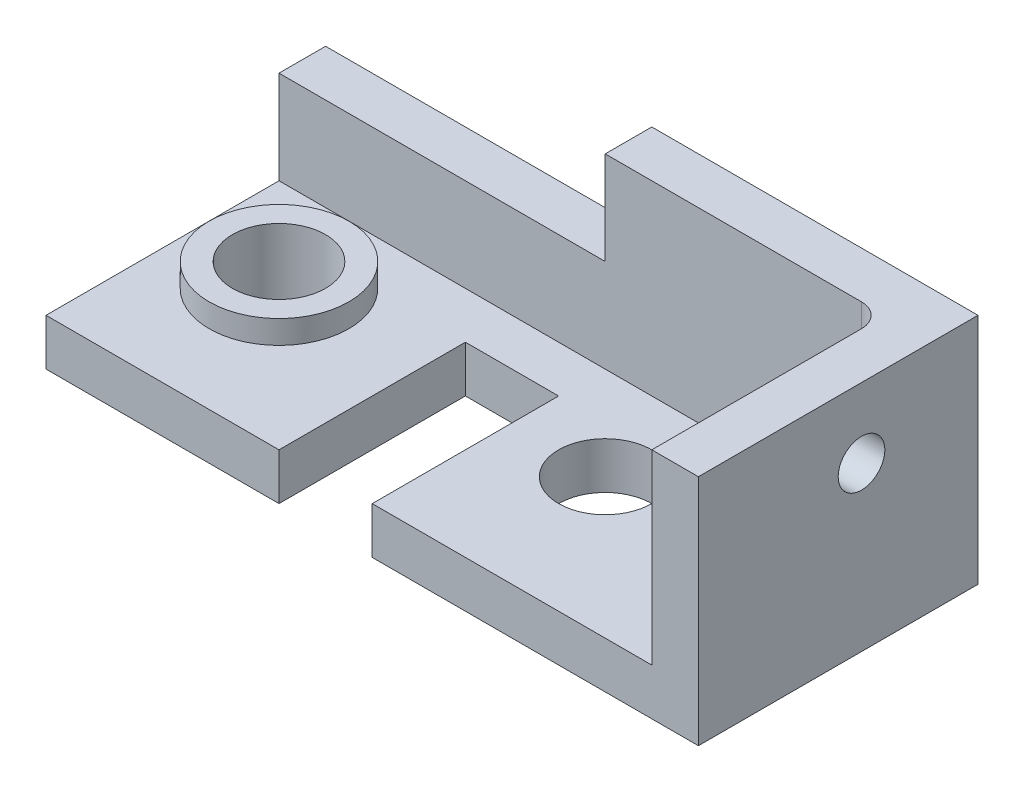
ISO-10303-21;
HEADER;
FILE_DESCRIPTION(('STEP AP214'),'2;1');
FILE_NAME('part.step','',(''),(''),'','','');
FILE_SCHEMA(('AUTOMOTIVE_DESIGN { 1 0 10303 214 1 1 1 1 }'));
ENDSEC;
DATA;
#1=APPLICATION_CONTEXT('core data for automotive mechanical design processes');
#2=APPLICATION_PROTOCOL_DEFINITION('international standard','automotive_design',2000,#1);
#3=PRODUCT_CONTEXT('',#1,'mechanical');
#4=PRODUCT('Part','Part','',(#3));
#5=PRODUCT_RELATED_PRODUCT_CATEGORY('part','',(#4));
#6=PRODUCT_DEFINITION_FORMATION('','',#4);
#7=PRODUCT_DEFINITION_CONTEXT('part definition',#1,'design');
#8=PRODUCT_DEFINITION('design','',#6,#7);
#9=PRODUCT_DEFINITION_SHAPE('','',#8);
#10=(LENGTH_UNIT() NAMED_UNIT(*) SI_UNIT(.MILLI.,.METRE.));
#11=(NAMED_UNIT(*) PLANE_ANGLE_UNIT() SI_UNIT($,.RADIAN.));
#12=(NAMED_UNIT(*) SI_UNIT($,.STERADIAN.) SOLID_ANGLE_UNIT());
#13=UNCERTAINTY_MEASURE_WITH_UNIT(LENGTH_MEASURE(1.E-05),#10,'distance_accuracy_value','');
#14=(GEOMETRIC_REPRESENTATION_CONTEXT(3) GLOBAL_UNCERTAINTY_ASSIGNED_CONTEXT((#13)) GLOBAL_UNIT_ASSIGNED_CONTEXT((#10,
#11,#12)) REPRESENTATION_CONTEXT('',''));
#15=CARTESIAN_POINT('',(0.,0.,0.));
#16=DIRECTION('',(0.,0.,1.));
#17=DIRECTION('',(1.,0.,0.));
#18=AXIS2_PLACEMENT_3D('',#15,#16,#17);
#19=CARTESIAN_POINT('',(0.,0.,60.));
#20=DIRECTION('',(0.,0.,-1.));
#21=DIRECTION('',(-1.,0.,0.));
#22=AXIS2_PLACEMENT_3D('',#19,#20,#21);
#23=PLANE('',#22);
#24=DIRECTION('',(1.,0.,0.));
#25=VECTOR('',#24,1.);
#26=CARTESIAN_POINT('',(0.,10.,60.));
#27=LINE('',#26,#25);
#28=CARTESIAN_POINT('',(70.,10.,60.));
#29=VERTEX_POINT('',#28);
#30=CARTESIAN_POINT('',(130.,10.,60.));
#31=VERTEX_POINT('',#30);
#32=EDGE_CURVE('E202',#29,#31,#27,.T.);
#33=ORIENTED_EDGE('',*,*,#32,.F.);
#34=DIRECTION('',(0.,1.,0.));
#35=VECTOR('',#34,1.);
#36=CARTESIAN_POINT('',(70.,0.,60.));
#37=LINE('',#36,#35);
#38=CARTESIAN_POINT('',(70.,0.,60.));
#39=VERTEX_POINT('',#38);
#40=EDGE_CURVE('E168',#39,#29,#37,.T.);
#41=ORIENTED_EDGE('',*,*,#40,.F.);
#42=DIRECTION('',(1.,0.,0.));
#43=VECTOR('',#42,1.);
#44=CARTESIAN_POINT('',(0.,0.,60.));
#45=LINE('',#44,#43);
#46=CARTESIAN_POINT('',(140.,0.,60.));
#47=VERTEX_POINT('',#46);
#48=EDGE_CURVE('E155',#39,#47,#45,.T.);
#49=ORIENTED_EDGE('',*,*,#48,.T.);
#50=DIRECTION('',(0.,1.,0.));
#51=VECTOR('',#50,1.);
#52=CARTESIAN_POINT('',(140.,0.,60.));
#53=LINE('',#52,#51);
#54=CARTESIAN_POINT('',(140.,50.,60.));
#55=VERTEX_POINT('',#54);
#56=EDGE_CURVE('E228',#47,#55,#53,.T.);
#57=ORIENTED_EDGE('',*,*,#56,.T.);
#58=DIRECTION('',(-1.,0.,0.));
#59=VECTOR('',#58,1.);
#60=CARTESIAN_POINT('',(0.,50.,60.));
#61=LINE('',#60,#59);
#62=CARTESIAN_POINT('',(130.,50.,60.));
#63=VERTEX_POINT('',#62);
#64=EDGE_CURVE('E230',#55,#63,#61,.T.);
#65=ORIENTED_EDGE('',*,*,#64,.T.);
#66=DIRECTION('',(0.,1.,0.));
#67=VECTOR('',#66,1.);
#68=CARTESIAN_POINT('',(130.,10.,60.));
#69=LINE('',#68,#67);
#70=EDGE_CURVE('E212',#31,#63,#69,.T.);
#71=ORIENTED_EDGE('',*,*,#70,.F.);
#72=EDGE_LOOP('',(#33,#41,#49,#57,#65,#71));
#73=FACE_BOUND('',#72,.T.);
#74=ADVANCED_FACE('F33',(#73),#23,.F.);
#75=CARTESIAN_POINT('',(0.,0.,60.));
#76=DIRECTION('',(1.,0.,0.));
#77=DIRECTION('',(0.,0.,-1.));
#78=AXIS2_PLACEMENT_3D('',#75,#76,#77);
#79=PLANE('',#78);
#80=DIRECTION('',(0.,1.,0.));
#81=VECTOR('',#80,1.);
#82=CARTESIAN_POINT('',(0.,10.,10.));
#83=LINE('',#82,#81);
#84=CARTESIAN_POINT('',(0.,10.,10.));
#85=VERTEX_POINT('',#84);
#86=CARTESIAN_POINT('',(0.,30.,10.));
#87=VERTEX_POINT('',#86);
#88=EDGE_CURVE('E217',#85,#87,#83,.T.);
#89=ORIENTED_EDGE('',*,*,#88,.T.);
#90=DIRECTION('',(0.,0.,1.));
#91=VECTOR('',#90,1.);
#92=CARTESIAN_POINT('',(0.,30.,0.));
#93=LINE('',#92,#91);
#94=CARTESIAN_POINT('',(0.,30.,0.));
#95=VERTEX_POINT('',#94);
#96=EDGE_CURVE('E56',#95,#87,#93,.T.);
#97=ORIENTED_EDGE('',*,*,#96,.F.);
#98=DIRECTION('',(0.,-1.,0.));
#99=VECTOR('',#98,1.);
#100=CARTESIAN_POINT('',(0.,0.,0.));
#101=LINE('',#100,#99);
#102=CARTESIAN_POINT('',(0.,0.,0.));
#103=VERTEX_POINT('',#102);
#104=EDGE_CURVE('E220',#95,#103,#101,.T.);
#105=ORIENTED_EDGE('',*,*,#104,.T.);
#106=DIRECTION('',(0.,0.,-1.));
#107=VECTOR('',#106,1.);
#108=CARTESIAN_POINT('',(0.,0.,60.));
#109=LINE('',#108,#107);
#110=CARTESIAN_POINT('',(0.,0.,60.));
#111=VERTEX_POINT('',#110);
#112=EDGE_CURVE('E246',#111,#103,#109,.T.);
#113=ORIENTED_EDGE('',*,*,#112,.F.);
#114=DIRECTION('',(0.,-1.,0.));
#115=VECTOR('',#114,1.);
#116=CARTESIAN_POINT('',(0.,0.,60.));
#117=LINE('',#116,#115);
#118=CARTESIAN_POINT('',(0.,10.,60.));
#119=VERTEX_POINT('',#118);
#120=EDGE_CURVE('E222',#119,#111,#117,.T.);
#121=ORIENTED_EDGE('',*,*,#120,.F.);
#122=DIRECTION('',(0.,0.,1.));
#123=VECTOR('',#122,1.);
#124=CARTESIAN_POINT('',(0.,10.,60.));
#125=LINE('',#124,#123);
#126=EDGE_CURVE('E200',#85,#119,#125,.T.);
#127=ORIENTED_EDGE('',*,*,#126,.F.);
#128=EDGE_LOOP('',(#89,#97,#105,#113,#121,#127));
#129=FACE_BOUND('',#128,.T.);
#130=ADVANCED_FACE('F278',(#129),#79,.F.);
#131=CARTESIAN_POINT('',(0.,0.,60.));
#132=DIRECTION('',(0.,1.,0.));
#133=DIRECTION('',(0.,0.,1.));
#134=AXIS2_PLACEMENT_3D('',#131,#132,#133);
#135=PLANE('',#134);
#136=CARTESIAN_POINT('',(90.,0.,30.));
#137=DIRECTION('',(0.,1.,0.));
#138=DIRECTION('',(0.,0.,1.));
#139=AXIS2_PLACEMENT_3D('',#136,#137,#138);
#140=CIRCLE('',#139,9.99999999999999);
#141=CARTESIAN_POINT('',(90.,0.,40.));
#142=VERTEX_POINT('',#141);
#143=EDGE_CURVE('E166',#142,#142,#140,.T.);
#144=ORIENTED_EDGE('',*,*,#143,.T.);
#145=EDGE_LOOP('',(#144));
#146=FACE_BOUND('',#145,.T.);
#147=ORIENTED_EDGE('',*,*,#48,.F.);
#148=DIRECTION('',(0.,0.,-1.));
#149=VECTOR('',#148,1.);
#150=CARTESIAN_POINT('',(70.,0.,20.));
#151=LINE('',#150,#149);
#152=CARTESIAN_POINT('',(70.,0.,20.));
#153=VERTEX_POINT('',#152);
#154=EDGE_CURVE('E136',#39,#153,#151,.T.);
#155=ORIENTED_EDGE('',*,*,#154,.T.);
#156=DIRECTION('',(-1.,0.,0.));
#157=VECTOR('',#156,1.);
#158=CARTESIAN_POINT('',(70.,0.,20.));
#159=LINE('',#158,#157);
#160=CARTESIAN_POINT('',(50.,0.,20.));
#161=VERTEX_POINT('',#160);
#162=EDGE_CURVE('E145',#153,#161,#159,.T.);
#163=ORIENTED_EDGE('',*,*,#162,.T.);
#164=DIRECTION('',(0.,0.,1.));
#165=VECTOR('',#164,1.);
#166=CARTESIAN_POINT('',(50.,0.,20.));
#167=LINE('',#166,#165);
#168=CARTESIAN_POINT('',(50.,0.,60.));
#169=VERTEX_POINT('',#168);
#170=EDGE_CURVE('E142',#161,#169,#167,.T.);
#171=ORIENTED_EDGE('',*,*,#170,.T.);
#172=EDGE_CURVE('E225',#111,#169,#45,.T.);
#173=ORIENTED_EDGE('',*,*,#172,.F.);
#174=ORIENTED_EDGE('',*,*,#112,.T.);
#175=DIRECTION('',(1.,0.,0.));
#176=VECTOR('',#175,1.);
#177=CARTESIAN_POINT('',(0.,0.,0.));
#178=LINE('',#177,#176);
#179=CARTESIAN_POINT('',(140.,0.,0.));
#180=VERTEX_POINT('',#179);
#181=EDGE_CURVE('E235',#103,#180,#178,.T.);
#182=ORIENTED_EDGE('',*,*,#181,.T.);
#183=DIRECTION('',(0.,0.,-1.));
#184=VECTOR('',#183,1.);
#185=CARTESIAN_POINT('',(140.,0.,60.));
#186=LINE('',#185,#184);
#187=EDGE_CURVE('E243',#47,#180,#186,.T.);
#188=ORIENTED_EDGE('',*,*,#187,.F.);
#189=EDGE_LOOP('',(#147,#155,#163,#171,#173,#174,#182,#188));
#190=FACE_BOUND('',#189,.T.);
#191=CARTESIAN_POINT('',(20.,0.,30.));
#192=DIRECTION('',(0.,1.,0.));
#193=DIRECTION('',(0.,0.,1.));
#194=AXIS2_PLACEMENT_3D('',#191,#192,#193);
#195=CIRCLE('',#194,10.);
#196=CARTESIAN_POINT('',(20.,0.,40.));
#197=VERTEX_POINT('',#196);
#198=EDGE_CURVE('E187',#197,#197,#195,.T.);
#199=ORIENTED_EDGE('',*,*,#198,.T.);
#200=EDGE_LOOP('',(#199));
#201=FACE_BOUND('',#200,.T.);
#202=ADVANCED_FACE('F152',(#146,#190,#201),#135,.F.);
#203=CARTESIAN_POINT('',(140.,0.,60.));
#204=DIRECTION('',(-1.,0.,0.));
#205=DIRECTION('',(0.,0.,1.));
#206=AXIS2_PLACEMENT_3D('',#203,#204,#205);
#207=PLANE('',#206);
#208=CARTESIAN_POINT('',(140.,35.,25.));
#209=DIRECTION('',(-1.,0.,0.));
#210=DIRECTION('',(0.,0.,1.));
#211=AXIS2_PLACEMENT_3D('',#208,#209,#210);
#212=CIRCLE('',#211,5.);
#213=CARTESIAN_POINT('',(140.,35.,30.));
#214=VERTEX_POINT('',#213);
#215=EDGE_CURVE('E340',#214,#214,#212,.T.);
#216=ORIENTED_EDGE('',*,*,#215,.T.);
#217=EDGE_LOOP('',(#216));
#218=FACE_BOUND('',#217,.T.);
#219=DIRECTION('',(0.,1.,0.));
#220=VECTOR('',#219,1.);
#221=CARTESIAN_POINT('',(140.,0.,0.));
#222=LINE('',#221,#220);
#223=CARTESIAN_POINT('',(140.,50.,0.));
#224=VERTEX_POINT('',#223);
#225=EDGE_CURVE('E237',#180,#224,#222,.T.);
#226=ORIENTED_EDGE('',*,*,#225,.T.);
#227=DIRECTION('',(0.,0.,-1.));
#228=VECTOR('',#227,1.);
#229=CARTESIAN_POINT('',(140.,50.,60.));
#230=LINE('',#229,#228);
#231=EDGE_CURVE('E233',#55,#224,#230,.T.);
#232=ORIENTED_EDGE('',*,*,#231,.F.);
#233=ORIENTED_EDGE('',*,*,#56,.F.);
#234=ORIENTED_EDGE('',*,*,#187,.T.);
#235=EDGE_LOOP('',(#226,#232,#233,#234));
#236=FACE_BOUND('',#235,.T.);
#237=ADVANCED_FACE('F295',(#218,#236),#207,.F.);
#238=CARTESIAN_POINT('',(0.,50.,60.));
#239=DIRECTION('',(0.,-1.,0.));
#240=DIRECTION('',(0.,0.,-1.));
#241=AXIS2_PLACEMENT_3D('',#238,#239,#240);
#242=PLANE('',#241);
#243=DIRECTION('',(-1.,0.,0.));
#244=VECTOR('',#243,1.);
#245=CARTESIAN_POINT('',(0.,50.,0.));
#246=LINE('',#245,#244);
#247=CARTESIAN_POINT('',(70.,50.,0.));
#248=VERTEX_POINT('',#247);
#249=EDGE_CURVE('E224',#224,#248,#246,.T.);
#250=ORIENTED_EDGE('',*,*,#249,.T.);
#251=DIRECTION('',(0.,0.,1.));
#252=VECTOR('',#251,1.);
#253=CARTESIAN_POINT('',(70.,50.,0.));
#254=LINE('',#253,#252);
#255=CARTESIAN_POINT('',(70.,50.,10.));
#256=VERTEX_POINT('',#255);
#257=EDGE_CURVE('E184',#248,#256,#254,.T.);
#258=ORIENTED_EDGE('',*,*,#257,.T.);
#259=DIRECTION('',(-1.,0.,0.));
#260=VECTOR('',#259,1.);
#261=CARTESIAN_POINT('',(0.,50.,10.));
#262=LINE('',#261,#260);
#263=CARTESIAN_POINT('',(125.,50.,10.));
#264=VERTEX_POINT('',#263);
#265=EDGE_CURVE('E203',#264,#256,#262,.T.);
#266=ORIENTED_EDGE('',*,*,#265,.F.);
#267=CARTESIAN_POINT('',(125.,50.,15.));
#268=DIRECTION('',(0.,-1.,0.));
#269=DIRECTION('',(0.,0.,-1.));
#270=AXIS2_PLACEMENT_3D('',#267,#268,#269);
#271=CIRCLE('',#270,5.);
#272=CARTESIAN_POINT('',(130.,50.,15.));
#273=VERTEX_POINT('',#272);
#274=EDGE_CURVE('E41',#264,#273,#271,.T.);
#275=ORIENTED_EDGE('',*,*,#274,.T.);
#276=DIRECTION('',(0.,0.,-1.));
#277=VECTOR('',#276,1.);
#278=CARTESIAN_POINT('',(130.,50.,60.));
#279=LINE('',#278,#277);
#280=EDGE_CURVE('E199',#63,#273,#279,.T.);
#281=ORIENTED_EDGE('',*,*,#280,.F.);
#282=ORIENTED_EDGE('',*,*,#64,.F.);
#283=ORIENTED_EDGE('',*,*,#231,.T.);
#284=EDGE_LOOP('',(#250,#258,#266,#275,#281,#282,#283));
#285=FACE_BOUND('',#284,.T.);
#286=ADVANCED_FACE('F258',(#285),#242,.F.);
#287=ORIENTED_EDGE('',*,*,#172,.T.);
#288=DIRECTION('',(0.,1.,0.));
#289=VECTOR('',#288,1.);
#290=CARTESIAN_POINT('',(50.,0.,60.));
#291=LINE('',#290,#289);
#292=CARTESIAN_POINT('',(50.,10.,60.));
#293=VERTEX_POINT('',#292);
#294=EDGE_CURVE('E171',#169,#293,#291,.T.);
#295=ORIENTED_EDGE('',*,*,#294,.T.);
#296=EDGE_CURVE('E204',#119,#293,#27,.T.);
#297=ORIENTED_EDGE('',*,*,#296,.F.);
#298=ORIENTED_EDGE('',*,*,#120,.T.);
#299=EDGE_LOOP('',(#287,#295,#297,#298));
#300=FACE_BOUND('',#299,.T.);
#301=ADVANCED_FACE('F283',(#300),#23,.F.);
#302=CARTESIAN_POINT('',(0.,0.,0.));
#303=DIRECTION('',(0.,0.,-1.));
#304=DIRECTION('',(-1.,0.,0.));
#305=AXIS2_PLACEMENT_3D('',#302,#303,#304);
#306=PLANE('',#305);
#307=DIRECTION('',(0.,1.,0.));
#308=VECTOR('',#307,1.);
#309=CARTESIAN_POINT('',(70.,50.,0.));
#310=LINE('',#309,#308);
#311=CARTESIAN_POINT('',(70.,30.,0.));
#312=VERTEX_POINT('',#311);
#313=EDGE_CURVE('E178',#312,#248,#310,.T.);
#314=ORIENTED_EDGE('',*,*,#313,.T.);
#315=ORIENTED_EDGE('',*,*,#249,.F.);
#316=ORIENTED_EDGE('',*,*,#225,.F.);
#317=ORIENTED_EDGE('',*,*,#181,.F.);
#318=ORIENTED_EDGE('',*,*,#104,.F.);
#319=DIRECTION('',(1.,0.,0.));
#320=VECTOR('',#319,1.);
#321=CARTESIAN_POINT('',(0.,30.,0.));
#322=LINE('',#321,#320);
#323=EDGE_CURVE('E175',#95,#312,#322,.T.);
#324=ORIENTED_EDGE('',*,*,#323,.T.);
#325=EDGE_LOOP('',(#314,#315,#316,#317,#318,#324));
#326=FACE_BOUND('',#325,.T.);
#327=ADVANCED_FACE('F291',(#326),#306,.T.);
#328=CARTESIAN_POINT('',(0.,10.,10.));
#329=DIRECTION('',(0.,0.,-1.));
#330=DIRECTION('',(-1.,0.,0.));
#331=AXIS2_PLACEMENT_3D('',#328,#329,#330);
#332=PLANE('',#331);
#333=ORIENTED_EDGE('',*,*,#265,.T.);
#334=DIRECTION('',(0.,1.,0.));
#335=VECTOR('',#334,1.);
#336=CARTESIAN_POINT('',(70.,50.,10.));
#337=LINE('',#336,#335);
#338=CARTESIAN_POINT('',(70.,30.,10.));
#339=VERTEX_POINT('',#338);
#340=EDGE_CURVE('E179',#339,#256,#337,.T.);
#341=ORIENTED_EDGE('',*,*,#340,.F.);
#342=DIRECTION('',(1.,0.,0.));
#343=VECTOR('',#342,1.);
#344=CARTESIAN_POINT('',(0.,30.,10.));
#345=LINE('',#344,#343);
#346=EDGE_CURVE('E170',#87,#339,#345,.T.);
#347=ORIENTED_EDGE('',*,*,#346,.F.);
#348=ORIENTED_EDGE('',*,*,#88,.F.);
#349=DIRECTION('',(-1.,0.,0.));
#350=VECTOR('',#349,1.);
#351=CARTESIAN_POINT('',(0.,10.,10.));
#352=LINE('',#351,#350);
#353=CARTESIAN_POINT('',(125.,10.,10.));
#354=VERTEX_POINT('',#353);
#355=EDGE_CURVE('E210',#354,#85,#352,.T.);
#356=ORIENTED_EDGE('',*,*,#355,.F.);
#357=DIRECTION('',(0.,1.,0.));
#358=VECTOR('',#357,1.);
#359=CARTESIAN_POINT('',(125.,50.,10.));
#360=LINE('',#359,#358);
#361=EDGE_CURVE('E249',#354,#264,#360,.T.);
#362=ORIENTED_EDGE('',*,*,#361,.T.);
#363=EDGE_LOOP('',(#333,#341,#347,#348,#356,#362));
#364=FACE_BOUND('',#363,.T.);
#365=ADVANCED_FACE('F273',(#364),#332,.F.);
#366=CARTESIAN_POINT('',(130.,10.,60.));
#367=DIRECTION('',(1.,0.,0.));
#368=DIRECTION('',(0.,0.,-1.));
#369=AXIS2_PLACEMENT_3D('',#366,#367,#368);
#370=PLANE('',#369);
#371=CARTESIAN_POINT('',(130.,35.,25.));
#372=DIRECTION('',(-1.,0.,0.));
#373=DIRECTION('',(0.,0.,1.));
#374=AXIS2_PLACEMENT_3D('',#371,#372,#373);
#375=CIRCLE('',#374,5.);
#376=CARTESIAN_POINT('',(130.,35.,30.));
#377=VERTEX_POINT('',#376);
#378=EDGE_CURVE('E342',#377,#377,#375,.T.);
#379=ORIENTED_EDGE('',*,*,#378,.F.);
#380=EDGE_LOOP('',(#379));
#381=FACE_BOUND('',#380,.T.);
#382=ORIENTED_EDGE('',*,*,#280,.T.);
#383=DIRECTION('',(0.,1.,0.));
#384=VECTOR('',#383,1.);
#385=CARTESIAN_POINT('',(130.,10.,15.));
#386=LINE('',#385,#384);
#387=CARTESIAN_POINT('',(130.,10.,15.));
#388=VERTEX_POINT('',#387);
#389=EDGE_CURVE('E252',#273,#388,#386,.F.);
#390=ORIENTED_EDGE('',*,*,#389,.T.);
#391=DIRECTION('',(0.,0.,-1.));
#392=VECTOR('',#391,1.);
#393=CARTESIAN_POINT('',(130.,10.,60.));
#394=LINE('',#393,#392);
#395=EDGE_CURVE('E207',#31,#388,#394,.T.);
#396=ORIENTED_EDGE('',*,*,#395,.F.);
#397=ORIENTED_EDGE('',*,*,#70,.T.);
#398=EDGE_LOOP('',(#382,#390,#396,#397));
#399=FACE_BOUND('',#398,.T.);
#400=ADVANCED_FACE('F264',(#381,#399),#370,.F.);
#401=CARTESIAN_POINT('',(0.,10.,0.));
#402=DIRECTION('',(0.,-1.,0.));
#403=DIRECTION('',(0.,0.,-1.));
#404=AXIS2_PLACEMENT_3D('',#401,#402,#403);
#405=PLANE('',#404);
#406=CARTESIAN_POINT('',(90.,10.,30.));
#407=DIRECTION('',(0.,1.,0.));
#408=DIRECTION('',(0.,0.,1.));
#409=AXIS2_PLACEMENT_3D('',#406,#407,#408);
#410=CIRCLE('',#409,9.99999999999999);
#411=CARTESIAN_POINT('',(90.,10.,40.));
#412=VERTEX_POINT('',#411);
#413=EDGE_CURVE('E161',#412,#412,#410,.T.);
#414=ORIENTED_EDGE('',*,*,#413,.F.);
#415=EDGE_LOOP('',(#414));
#416=FACE_BOUND('',#415,.T.);
#417=CARTESIAN_POINT('',(20.,10.,30.));
#418=DIRECTION('',(0.,-1.,0.));
#419=DIRECTION('',(0.,0.,-1.));
#420=AXIS2_PLACEMENT_3D('',#417,#418,#419);
#421=CIRCLE('',#420,15.);
#422=CARTESIAN_POINT('',(20.,10.,15.));
#423=VERTEX_POINT('',#422);
#424=EDGE_CURVE('E11',#423,#423,#421,.F.);
#425=ORIENTED_EDGE('',*,*,#424,.F.);
#426=EDGE_LOOP('',(#425));
#427=FACE_BOUND('',#426,.T.);
#428=DIRECTION('',(-1.,0.,0.));
#429=VECTOR('',#428,1.);
#430=CARTESIAN_POINT('',(70.,10.,20.));
#431=LINE('',#430,#429);
#432=CARTESIAN_POINT('',(70.,10.,20.));
#433=VERTEX_POINT('',#432);
#434=CARTESIAN_POINT('',(50.,10.,20.));
#435=VERTEX_POINT('',#434);
#436=EDGE_CURVE('E158',#433,#435,#431,.T.);
#437=ORIENTED_EDGE('',*,*,#436,.F.);
#438=DIRECTION('',(0.,0.,-1.));
#439=VECTOR('',#438,1.);
#440=CARTESIAN_POINT('',(70.,10.,20.));
#441=LINE('',#440,#439);
#442=EDGE_CURVE('E48',#29,#433,#441,.T.);
#443=ORIENTED_EDGE('',*,*,#442,.F.);
#444=ORIENTED_EDGE('',*,*,#32,.T.);
#445=ORIENTED_EDGE('',*,*,#395,.T.);
#446=CARTESIAN_POINT('',(125.,10.,15.));
#447=DIRECTION('',(0.,-1.,0.));
#448=DIRECTION('',(0.,0.,-1.));
#449=AXIS2_PLACEMENT_3D('',#446,#447,#448);
#450=CIRCLE('',#449,5.);
#451=EDGE_CURVE('E254',#388,#354,#450,.F.);
#452=ORIENTED_EDGE('',*,*,#451,.T.);
#453=ORIENTED_EDGE('',*,*,#355,.T.);
#454=ORIENTED_EDGE('',*,*,#126,.T.);
#455=ORIENTED_EDGE('',*,*,#296,.T.);
#456=DIRECTION('',(0.,0.,1.));
#457=VECTOR('',#456,1.);
#458=CARTESIAN_POINT('',(50.,10.,20.));
#459=LINE('',#458,#457);
#460=EDGE_CURVE('E156',#435,#293,#459,.T.);
#461=ORIENTED_EDGE('',*,*,#460,.F.);
#462=EDGE_LOOP('',(#437,#443,#444,#445,#452,#453,#454,#455,#461));
#463=FACE_BOUND('',#462,.T.);
#464=ADVANCED_FACE('F270',(#416,#427,#463),#405,.F.);
#465=CARTESIAN_POINT('',(125.,10.,15.));
#466=DIRECTION('',(0.,-1.,0.));
#467=DIRECTION('',(0.,0.,-1.));
#468=AXIS2_PLACEMENT_3D('',#465,#466,#467);
#469=CYLINDRICAL_SURFACE('',#468,5.);
#470=ORIENTED_EDGE('',*,*,#451,.F.);
#471=ORIENTED_EDGE('',*,*,#389,.F.);
#472=ORIENTED_EDGE('',*,*,#274,.F.);
#473=ORIENTED_EDGE('',*,*,#361,.F.);
#474=EDGE_LOOP('',(#470,#471,#472,#473));
#475=FACE_BOUND('',#474,.T.);
#476=ADVANCED_FACE('F35',(#475),#469,.F.);
#477=CARTESIAN_POINT('',(20.,15.,30.));
#478=DIRECTION('',(0.,1.,0.));
#479=DIRECTION('',(0.,0.,1.));
#480=AXIS2_PLACEMENT_3D('',#477,#478,#479);
#481=PLANE('',#480);
#482=CARTESIAN_POINT('',(20.,15.,30.));
#483=DIRECTION('',(0.,1.,0.));
#484=DIRECTION('',(0.,0.,1.));
#485=AXIS2_PLACEMENT_3D('',#482,#483,#484);
#486=CIRCLE('',#485,15.);
#487=CARTESIAN_POINT('',(20.,15.,45.));
#488=VERTEX_POINT('',#487);
#489=EDGE_CURVE('E196',#488,#488,#486,.T.);
#490=ORIENTED_EDGE('',*,*,#489,.T.);
#491=EDGE_LOOP('',(#490));
#492=FACE_BOUND('',#491,.T.);
#493=CARTESIAN_POINT('',(20.,15.,30.));
#494=DIRECTION('',(0.,1.,0.));
#495=DIRECTION('',(0.,0.,1.));
#496=AXIS2_PLACEMENT_3D('',#493,#494,#495);
#497=CIRCLE('',#496,10.);
#498=CARTESIAN_POINT('',(20.,15.,40.));
#499=VERTEX_POINT('',#498);
#500=EDGE_CURVE('E193',#499,#499,#497,.T.);
#501=ORIENTED_EDGE('',*,*,#500,.F.);
#502=EDGE_LOOP('',(#501));
#503=FACE_BOUND('',#502,.T.);
#504=ADVANCED_FACE('F367',(#492,#503),#481,.T.);
#505=CARTESIAN_POINT('',(20.,15.,30.));
#506=DIRECTION('',(0.,-1.,0.));
#507=DIRECTION('',(0.,0.,-1.));
#508=AXIS2_PLACEMENT_3D('',#505,#506,#507);
#509=CYLINDRICAL_SURFACE('',#508,15.);
#510=ORIENTED_EDGE('',*,*,#489,.F.);
#511=EDGE_LOOP('',(#510));
#512=FACE_BOUND('',#511,.T.);
#513=ORIENTED_EDGE('',*,*,#424,.T.);
#514=EDGE_LOOP('',(#513));
#515=FACE_BOUND('',#514,.T.);
#516=ADVANCED_FACE('F364',(#512,#515),#509,.T.);
#517=CARTESIAN_POINT('',(20.,15.,30.));
#518=DIRECTION('',(0.,-1.,0.));
#519=DIRECTION('',(0.,0.,-1.));
#520=AXIS2_PLACEMENT_3D('',#517,#518,#519);
#521=CYLINDRICAL_SURFACE('',#520,10.);
#522=ORIENTED_EDGE('',*,*,#500,.T.);
#523=EDGE_LOOP('',(#522));
#524=FACE_BOUND('',#523,.T.);
#525=ORIENTED_EDGE('',*,*,#198,.F.);
#526=EDGE_LOOP('',(#525));
#527=FACE_BOUND('',#526,.T.);
#528=ADVANCED_FACE('F310',(#524,#527),#521,.F.);
#529=CARTESIAN_POINT('',(70.,50.,0.));
#530=DIRECTION('',(1.,0.,0.));
#531=DIRECTION('',(0.,0.,-1.));
#532=AXIS2_PLACEMENT_3D('',#529,#530,#531);
#533=PLANE('',#532);
#534=ORIENTED_EDGE('',*,*,#340,.T.);
#535=ORIENTED_EDGE('',*,*,#257,.F.);
#536=ORIENTED_EDGE('',*,*,#313,.F.);
#537=DIRECTION('',(0.,0.,1.));
#538=VECTOR('',#537,1.);
#539=CARTESIAN_POINT('',(70.,30.,0.));
#540=LINE('',#539,#538);
#541=EDGE_CURVE('E188',#312,#339,#540,.T.);
#542=ORIENTED_EDGE('',*,*,#541,.T.);
#543=EDGE_LOOP('',(#534,#535,#536,#542));
#544=FACE_BOUND('',#543,.T.);
#545=ADVANCED_FACE('F301',(#544),#533,.F.);
#546=CARTESIAN_POINT('',(0.,30.,0.));
#547=DIRECTION('',(0.,-1.,0.));
#548=DIRECTION('',(0.,0.,-1.));
#549=AXIS2_PLACEMENT_3D('',#546,#547,#548);
#550=PLANE('',#549);
#551=ORIENTED_EDGE('',*,*,#346,.T.);
#552=ORIENTED_EDGE('',*,*,#541,.F.);
#553=ORIENTED_EDGE('',*,*,#323,.F.);
#554=ORIENTED_EDGE('',*,*,#96,.T.);
#555=EDGE_LOOP('',(#551,#552,#553,#554));
#556=FACE_BOUND('',#555,.T.);
#557=ADVANCED_FACE('F302',(#556),#550,.F.);
#558=CARTESIAN_POINT('',(70.,0.,20.));
#559=DIRECTION('',(1.,0.,0.));
#560=DIRECTION('',(0.,0.,-1.));
#561=AXIS2_PLACEMENT_3D('',#558,#559,#560);
#562=PLANE('',#561);
#563=ORIENTED_EDGE('',*,*,#442,.T.);
#564=DIRECTION('',(0.,1.,0.));
#565=VECTOR('',#564,1.);
#566=CARTESIAN_POINT('',(70.,0.,20.));
#567=LINE('',#566,#565);
#568=EDGE_CURVE('E132',#153,#433,#567,.T.);
#569=ORIENTED_EDGE('',*,*,#568,.F.);
#570=ORIENTED_EDGE('',*,*,#154,.F.);
#571=ORIENTED_EDGE('',*,*,#40,.T.);
#572=EDGE_LOOP('',(#563,#569,#570,#571));
#573=FACE_BOUND('',#572,.T.);
#574=ADVANCED_FACE('F134',(#573),#562,.F.);
#575=CARTESIAN_POINT('',(50.,0.,20.));
#576=DIRECTION('',(-1.,0.,0.));
#577=DIRECTION('',(0.,0.,1.));
#578=AXIS2_PLACEMENT_3D('',#575,#576,#577);
#579=PLANE('',#578);
#580=ORIENTED_EDGE('',*,*,#460,.T.);
#581=ORIENTED_EDGE('',*,*,#294,.F.);
#582=ORIENTED_EDGE('',*,*,#170,.F.);
#583=DIRECTION('',(0.,1.,0.));
#584=VECTOR('',#583,1.);
#585=CARTESIAN_POINT('',(50.,0.,20.));
#586=LINE('',#585,#584);
#587=EDGE_CURVE('E141',#161,#435,#586,.T.);
#588=ORIENTED_EDGE('',*,*,#587,.T.);
#589=EDGE_LOOP('',(#580,#581,#582,#588));
#590=FACE_BOUND('',#589,.T.);
#591=ADVANCED_FACE('F286',(#590),#579,.F.);
#592=CARTESIAN_POINT('',(70.,0.,20.));
#593=DIRECTION('',(0.,0.,-1.));
#594=DIRECTION('',(-1.,0.,0.));
#595=AXIS2_PLACEMENT_3D('',#592,#593,#594);
#596=PLANE('',#595);
#597=ORIENTED_EDGE('',*,*,#436,.T.);
#598=ORIENTED_EDGE('',*,*,#587,.F.);
#599=ORIENTED_EDGE('',*,*,#162,.F.);
#600=ORIENTED_EDGE('',*,*,#568,.T.);
#601=EDGE_LOOP('',(#597,#598,#599,#600));
#602=FACE_BOUND('',#601,.T.);
#603=ADVANCED_FACE('F146',(#602),#596,.F.);
#604=CARTESIAN_POINT('',(90.,0.,30.));
#605=DIRECTION('',(0.,1.,0.));
#606=DIRECTION('',(0.,0.,1.));
#607=AXIS2_PLACEMENT_3D('',#604,#605,#606);
#608=CYLINDRICAL_SURFACE('',#607,9.99999999999999);
#609=ORIENTED_EDGE('',*,*,#143,.F.);
#610=EDGE_LOOP('',(#609));
#611=FACE_BOUND('',#610,.T.);
#612=ORIENTED_EDGE('',*,*,#413,.T.);
#613=EDGE_LOOP('',(#612));
#614=FACE_BOUND('',#613,.T.);
#615=ADVANCED_FACE('F351',(#611,#614),#608,.F.);
#616=CARTESIAN_POINT('',(140.,35.,25.));
#617=DIRECTION('',(-1.,0.,0.));
#618=DIRECTION('',(0.,0.,1.));
#619=AXIS2_PLACEMENT_3D('',#616,#617,#618);
#620=CYLINDRICAL_SURFACE('',#619,5.);
#621=ORIENTED_EDGE('',*,*,#215,.F.);
#622=EDGE_LOOP('',(#621));
#623=FACE_BOUND('',#622,.T.);
#624=ORIENTED_EDGE('',*,*,#378,.T.);
#625=EDGE_LOOP('',(#624));
#626=FACE_BOUND('',#625,.T.);
#627=ADVANCED_FACE('F348',(#623,#626),#620,.F.);
#628=CLOSED_SHELL('',(#74,#130,#202,#237,#286,#301,#327,#365,#400,#464,#476,#504,#516,#528,#545,
#557,#574,#591,#603,#615,#627));
#629=MANIFOLD_SOLID_BREP('B2',#628);
#630=ADVANCED_BREP_SHAPE_REPRESENTATION('',(#18,#629),#14);
#631=SHAPE_DEFINITION_REPRESENTATION(#9,#630);
ENDSEC;
END-ISO-10303-21;
